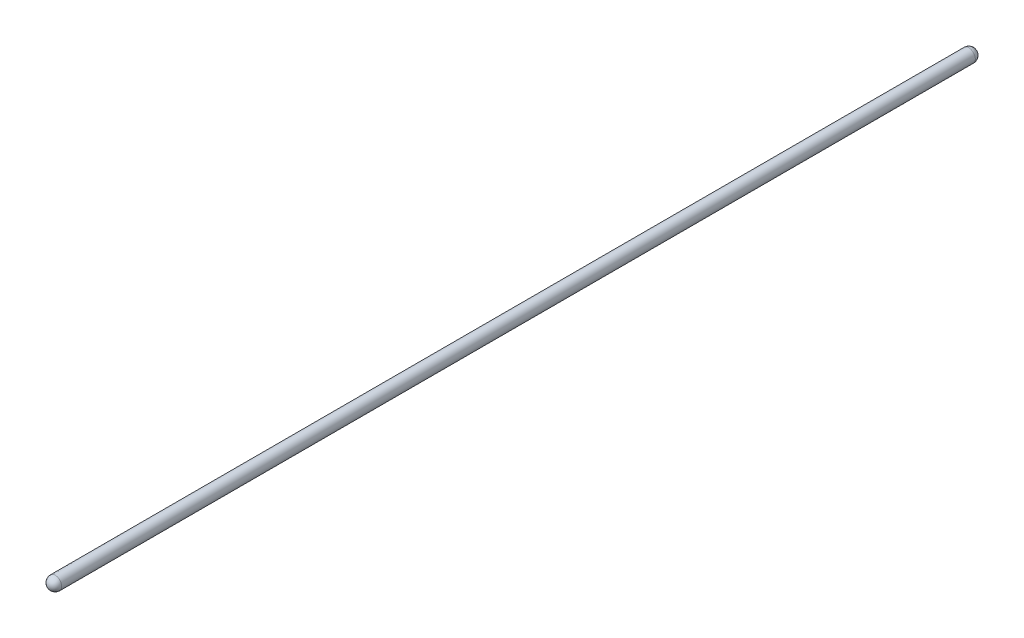
ISO-10303-21;
HEADER;
FILE_DESCRIPTION(('STEP AP214'),'2;1');
FILE_NAME('part.step','',(''),(''),'','','');
FILE_SCHEMA(('AUTOMOTIVE_DESIGN { 1 0 10303 214 1 1 1 1 }'));
ENDSEC;
DATA;
#1=APPLICATION_CONTEXT('core data for automotive mechanical design processes');
#2=APPLICATION_PROTOCOL_DEFINITION('international standard','automotive_design',2000,#1);
#3=PRODUCT_CONTEXT('',#1,'mechanical');
#4=PRODUCT('Part','Part','',(#3));
#5=PRODUCT_RELATED_PRODUCT_CATEGORY('part','',(#4));
#6=PRODUCT_DEFINITION_FORMATION('','',#4);
#7=PRODUCT_DEFINITION_CONTEXT('part definition',#1,'design');
#8=PRODUCT_DEFINITION('design','',#6,#7);
#9=PRODUCT_DEFINITION_SHAPE('','',#8);
#10=(LENGTH_UNIT() NAMED_UNIT(*) SI_UNIT(.MILLI.,.METRE.));
#11=(NAMED_UNIT(*) PLANE_ANGLE_UNIT() SI_UNIT($,.RADIAN.));
#12=(NAMED_UNIT(*) SI_UNIT($,.STERADIAN.) SOLID_ANGLE_UNIT());
#13=UNCERTAINTY_MEASURE_WITH_UNIT(LENGTH_MEASURE(1.E-05),#10,'distance_accuracy_value','');
#14=(GEOMETRIC_REPRESENTATION_CONTEXT(3) GLOBAL_UNCERTAINTY_ASSIGNED_CONTEXT((#13)) GLOBAL_UNIT_ASSIGNED_CONTEXT((#10,
#11,#12)) REPRESENTATION_CONTEXT('',''));
#15=CARTESIAN_POINT('',(0.,0.,0.));
#16=DIRECTION('',(0.,0.,1.));
#17=DIRECTION('',(1.,0.,0.));
#18=AXIS2_PLACEMENT_3D('',#15,#16,#17);
#19=CARTESIAN_POINT('',(0.,0.,0.));
#20=DIRECTION('',(0.,0.,-1.));
#21=DIRECTION('',(1.,0.,0.));
#22=AXIS2_PLACEMENT_3D('',#19,#20,#21);
#23=SPHERICAL_SURFACE('',#22,9.525);
#24=CARTESIAN_POINT('',(0.,0.,0.));
#25=DIRECTION('',(0.,0.,-1.));
#26=DIRECTION('',(-1.,0.,0.));
#27=AXIS2_PLACEMENT_3D('',#24,#25,#26);
#28=CIRCLE('',#27,9.525);
#29=CARTESIAN_POINT('',(-9.525,0.,0.));
#30=VERTEX_POINT('',#29);
#31=EDGE_CURVE('E10',#30,#30,#28,.T.);
#32=ORIENTED_EDGE('',*,*,#31,.T.);
#33=EDGE_LOOP('',(#32));
#34=FACE_BOUND('',#33,.T.);
#35=ADVANCED_FACE('F31',(#34),#23,.T.);
#36=CARTESIAN_POINT('',(0.,0.,-9.525));
#37=DIRECTION('',(0.,0.,-1.));
#38=DIRECTION('',(-1.,0.,0.));
#39=AXIS2_PLACEMENT_3D('',#36,#37,#38);
#40=CYLINDRICAL_SURFACE('',#39,9.52500000000001);
#41=ORIENTED_EDGE('',*,*,#31,.F.);
#42=EDGE_LOOP('',(#41));
#43=FACE_BOUND('',#42,.T.);
#44=CARTESIAN_POINT('',(1.641717093244E-13,0.,1331.03874));
#45=DIRECTION('',(0.,0.,-1.));
#46=DIRECTION('',(-1.,0.,0.));
#47=AXIS2_PLACEMENT_3D('',#44,#45,#46);
#48=CIRCLE('',#47,9.52500000000003);
#49=CARTESIAN_POINT('',(-9.52499999999987,0.,1331.03874));
#50=VERTEX_POINT('',#49);
#51=EDGE_CURVE('E37',#50,#50,#48,.T.);
#52=ORIENTED_EDGE('',*,*,#51,.T.);
#53=EDGE_LOOP('',(#52));
#54=FACE_BOUND('',#53,.T.);
#55=ADVANCED_FACE('F43',(#43,#54),#40,.T.);
#56=CARTESIAN_POINT('',(0.,0.,1331.03874));
#57=DIRECTION('',(0.,0.,-1.));
#58=DIRECTION('',(1.,0.,0.));
#59=AXIS2_PLACEMENT_3D('',#56,#57,#58);
#60=SPHERICAL_SURFACE('',#59,9.5250000000002);
#61=ORIENTED_EDGE('',*,*,#51,.F.);
#62=EDGE_LOOP('',(#61));
#63=FACE_BOUND('',#62,.T.);
#64=ADVANCED_FACE('F45',(#63),#60,.T.);
#65=CLOSED_SHELL('',(#35,#55,#64));
#66=MANIFOLD_SOLID_BREP('B2',#65);
#67=ADVANCED_BREP_SHAPE_REPRESENTATION('',(#18,#66),#14);
#68=SHAPE_DEFINITION_REPRESENTATION(#9,#67);
ENDSEC;
END-ISO-10303-21;
